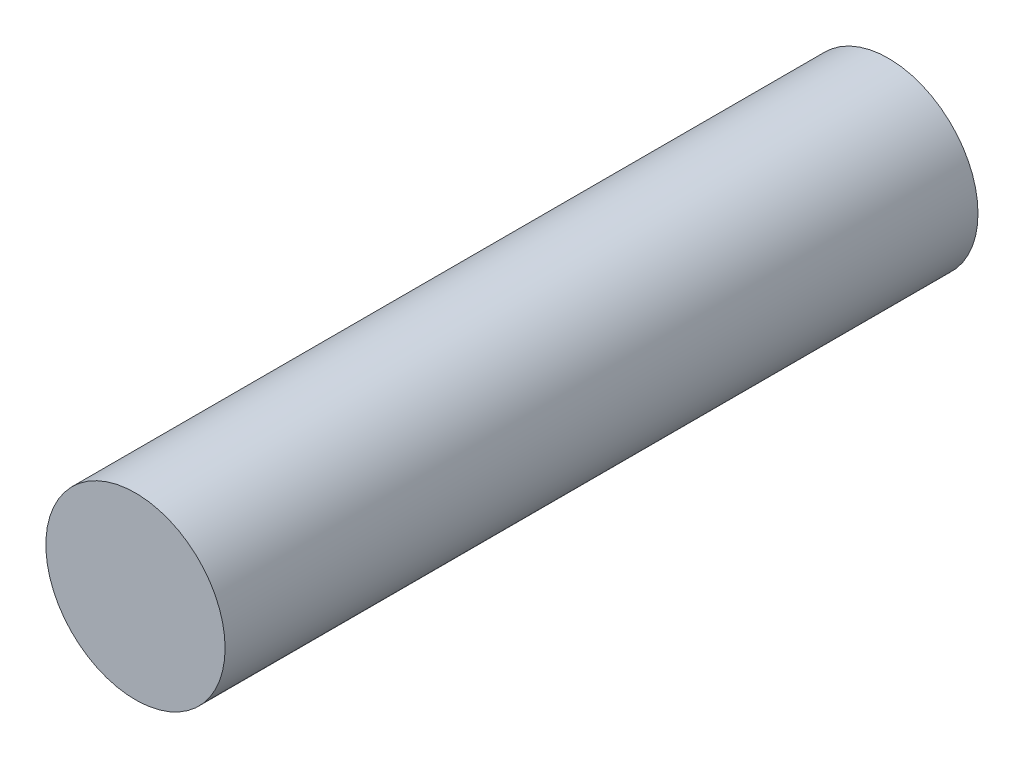
ISO-10303-21;
HEADER;
FILE_DESCRIPTION(('STEP AP214'),'2;1');
FILE_NAME('part.step','',(''),(''),'','','');
FILE_SCHEMA(('AUTOMOTIVE_DESIGN { 1 0 10303 214 1 1 1 1 }'));
ENDSEC;
DATA;
#1=APPLICATION_CONTEXT('core data for automotive mechanical design processes');
#2=APPLICATION_PROTOCOL_DEFINITION('international standard','automotive_design',2000,#1);
#3=PRODUCT_CONTEXT('',#1,'mechanical');
#4=PRODUCT('Part','Part','',(#3));
#5=PRODUCT_RELATED_PRODUCT_CATEGORY('part','',(#4));
#6=PRODUCT_DEFINITION_FORMATION('','',#4);
#7=PRODUCT_DEFINITION_CONTEXT('part definition',#1,'design');
#8=PRODUCT_DEFINITION('design','',#6,#7);
#9=PRODUCT_DEFINITION_SHAPE('','',#8);
#10=(LENGTH_UNIT() NAMED_UNIT(*) SI_UNIT(.MILLI.,.METRE.));
#11=(NAMED_UNIT(*) PLANE_ANGLE_UNIT() SI_UNIT($,.RADIAN.));
#12=(NAMED_UNIT(*) SI_UNIT($,.STERADIAN.) SOLID_ANGLE_UNIT());
#13=UNCERTAINTY_MEASURE_WITH_UNIT(LENGTH_MEASURE(1.E-05),#10,'distance_accuracy_value','');
#14=(GEOMETRIC_REPRESENTATION_CONTEXT(3) GLOBAL_UNCERTAINTY_ASSIGNED_CONTEXT((#13)) GLOBAL_UNIT_ASSIGNED_CONTEXT((#10,
#11,#12)) REPRESENTATION_CONTEXT('',''));
#15=CARTESIAN_POINT('',(0.,0.,0.));
#16=DIRECTION('',(0.,0.,1.));
#17=DIRECTION('',(1.,0.,0.));
#18=AXIS2_PLACEMENT_3D('',#15,#16,#17);
#19=CARTESIAN_POINT('',(0.,0.,31.5));
#20=DIRECTION('',(0.,0.,-1.));
#21=DIRECTION('',(-1.,0.,0.));
#22=AXIS2_PLACEMENT_3D('',#19,#20,#21);
#23=CYLINDRICAL_SURFACE('',#22,7.5);
#24=CARTESIAN_POINT('',(0.,0.,31.5));
#25=DIRECTION('',(0.,0.,1.));
#26=DIRECTION('',(1.,0.,0.));
#27=AXIS2_PLACEMENT_3D('',#24,#25,#26);
#28=CIRCLE('',#27,7.5);
#29=CARTESIAN_POINT('',(7.5,0.,31.5));
#30=VERTEX_POINT('',#29);
#31=EDGE_CURVE('E10',#30,#30,#28,.T.);
#32=ORIENTED_EDGE('',*,*,#31,.F.);
#33=EDGE_LOOP('',(#32));
#34=FACE_BOUND('',#33,.T.);
#35=CARTESIAN_POINT('',(0.,0.,-31.5));
#36=DIRECTION('',(0.,0.,1.));
#37=DIRECTION('',(1.,0.,0.));
#38=AXIS2_PLACEMENT_3D('',#35,#36,#37);
#39=CIRCLE('',#38,7.5);
#40=CARTESIAN_POINT('',(7.5,0.,-31.5));
#41=VERTEX_POINT('',#40);
#42=EDGE_CURVE('E37',#41,#41,#39,.T.);
#43=ORIENTED_EDGE('',*,*,#42,.T.);
#44=EDGE_LOOP('',(#43));
#45=FACE_BOUND('',#44,.T.);
#46=ADVANCED_FACE('F34',(#34,#45),#23,.T.);
#47=CARTESIAN_POINT('',(0.,0.,31.5));
#48=DIRECTION('',(0.,0.,1.));
#49=DIRECTION('',(1.,0.,0.));
#50=AXIS2_PLACEMENT_3D('',#47,#48,#49);
#51=PLANE('',#50);
#52=ORIENTED_EDGE('',*,*,#31,.T.);
#53=EDGE_LOOP('',(#52));
#54=FACE_BOUND('',#53,.T.);
#55=ADVANCED_FACE('F49',(#54),#51,.T.);
#56=CARTESIAN_POINT('',(0.,0.,-31.5));
#57=DIRECTION('',(0.,0.,1.));
#58=DIRECTION('',(1.,0.,0.));
#59=AXIS2_PLACEMENT_3D('',#56,#57,#58);
#60=PLANE('',#59);
#61=ORIENTED_EDGE('',*,*,#42,.F.);
#62=EDGE_LOOP('',(#61));
#63=FACE_BOUND('',#62,.T.);
#64=ADVANCED_FACE('F47',(#63),#60,.F.);
#65=CLOSED_SHELL('',(#46,#55,#64));
#66=MANIFOLD_SOLID_BREP('B2',#65);
#67=ADVANCED_BREP_SHAPE_REPRESENTATION('',(#18,#66),#14);
#68=SHAPE_DEFINITION_REPRESENTATION(#9,#67);
ENDSEC;
END-ISO-10303-21;
